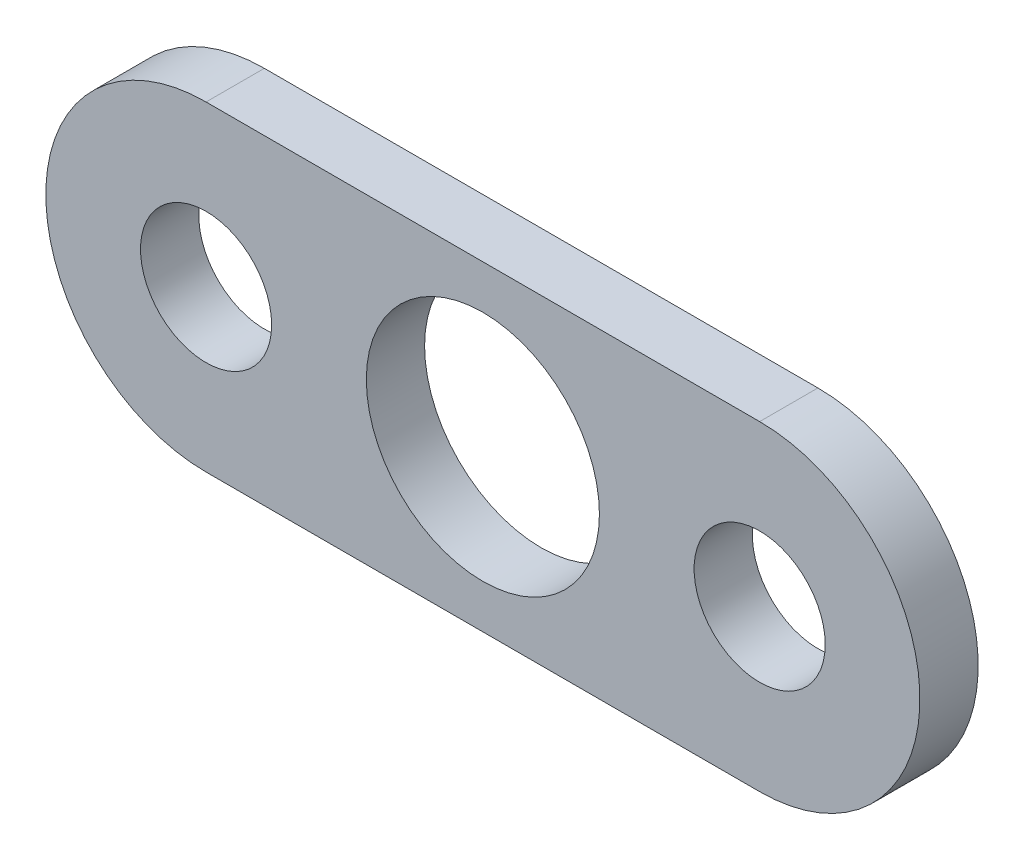
ISO-10303-21;
HEADER;
FILE_DESCRIPTION(('STEP AP214'),'2;1');
FILE_NAME('part.step','',(''),(''),'','','');
FILE_SCHEMA(('AUTOMOTIVE_DESIGN { 1 0 10303 214 1 1 1 1 }'));
ENDSEC;
DATA;
#1=APPLICATION_CONTEXT('core data for automotive mechanical design processes');
#2=APPLICATION_PROTOCOL_DEFINITION('international standard','automotive_design',2000,#1);
#3=PRODUCT_CONTEXT('',#1,'mechanical');
#4=PRODUCT('Part','Part','',(#3));
#5=PRODUCT_RELATED_PRODUCT_CATEGORY('part','',(#4));
#6=PRODUCT_DEFINITION_FORMATION('','',#4);
#7=PRODUCT_DEFINITION_CONTEXT('part definition',#1,'design');
#8=PRODUCT_DEFINITION('design','',#6,#7);
#9=PRODUCT_DEFINITION_SHAPE('','',#8);
#10=(LENGTH_UNIT() NAMED_UNIT(*) SI_UNIT(.MILLI.,.METRE.));
#11=(NAMED_UNIT(*) PLANE_ANGLE_UNIT() SI_UNIT($,.RADIAN.));
#12=(NAMED_UNIT(*) SI_UNIT($,.STERADIAN.) SOLID_ANGLE_UNIT());
#13=UNCERTAINTY_MEASURE_WITH_UNIT(LENGTH_MEASURE(1.E-05),#10,'distance_accuracy_value','');
#14=(GEOMETRIC_REPRESENTATION_CONTEXT(3) GLOBAL_UNCERTAINTY_ASSIGNED_CONTEXT((#13)) GLOBAL_UNIT_ASSIGNED_CONTEXT((#10,
#11,#12)) REPRESENTATION_CONTEXT('',''));
#15=CARTESIAN_POINT('',(0.,0.,0.));
#16=DIRECTION('',(0.,0.,1.));
#17=DIRECTION('',(1.,0.,0.));
#18=AXIS2_PLACEMENT_3D('',#15,#16,#17);
#19=CARTESIAN_POINT('',(-9.5,0.,2.));
#20=DIRECTION('',(0.,0.,1.));
#21=DIRECTION('',(1.,0.,0.));
#22=AXIS2_PLACEMENT_3D('',#19,#20,#21);
#23=PLANE('',#22);
#24=CARTESIAN_POINT('',(-9.5,0.,2.));
#25=DIRECTION('',(0.,0.,1.));
#26=DIRECTION('',(1.,0.,0.));
#27=AXIS2_PLACEMENT_3D('',#24,#25,#26);
#28=CIRCLE('',#27,2.24999999999999);
#29=CARTESIAN_POINT('',(-7.25000000000001,0.,2.));
#30=VERTEX_POINT('',#29);
#31=EDGE_CURVE('E128',#30,#30,#28,.T.);
#32=ORIENTED_EDGE('',*,*,#31,.F.);
#33=EDGE_LOOP('',(#32));
#34=FACE_BOUND('',#33,.T.);
#35=CARTESIAN_POINT('',(9.5,0.,2.));
#36=DIRECTION('',(0.,0.,1.));
#37=DIRECTION('',(1.,0.,0.));
#38=AXIS2_PLACEMENT_3D('',#35,#36,#37);
#39=CIRCLE('',#38,2.24999999999999);
#40=CARTESIAN_POINT('',(11.75,0.,2.));
#41=VERTEX_POINT('',#40);
#42=EDGE_CURVE('E122',#41,#41,#39,.T.);
#43=ORIENTED_EDGE('',*,*,#42,.F.);
#44=EDGE_LOOP('',(#43));
#45=FACE_BOUND('',#44,.T.);
#46=CARTESIAN_POINT('',(-9.5,0.,2.));
#47=DIRECTION('',(0.,0.,1.));
#48=DIRECTION('',(1.,0.,0.));
#49=AXIS2_PLACEMENT_3D('',#46,#47,#48);
#50=CIRCLE('',#49,5.5);
#51=CARTESIAN_POINT('',(-9.5,5.5,2.));
#52=VERTEX_POINT('',#51);
#53=CARTESIAN_POINT('',(-9.5,-5.5,2.));
#54=VERTEX_POINT('',#53);
#55=EDGE_CURVE('E87',#52,#54,#50,.T.);
#56=ORIENTED_EDGE('',*,*,#55,.T.);
#57=DIRECTION('',(1.,0.,0.));
#58=VECTOR('',#57,1.);
#59=CARTESIAN_POINT('',(-9.5,-5.5,2.));
#60=LINE('',#59,#58);
#61=CARTESIAN_POINT('',(9.5,-5.5,2.));
#62=VERTEX_POINT('',#61);
#63=EDGE_CURVE('E82',#54,#62,#60,.T.);
#64=ORIENTED_EDGE('',*,*,#63,.T.);
#65=CARTESIAN_POINT('',(9.5,0.,2.));
#66=DIRECTION('',(0.,0.,1.));
#67=DIRECTION('',(1.,0.,0.));
#68=AXIS2_PLACEMENT_3D('',#65,#66,#67);
#69=CIRCLE('',#68,5.5);
#70=CARTESIAN_POINT('',(9.5,5.5,2.));
#71=VERTEX_POINT('',#70);
#72=EDGE_CURVE('E85',#62,#71,#69,.T.);
#73=ORIENTED_EDGE('',*,*,#72,.T.);
#74=DIRECTION('',(-1.,0.,0.));
#75=VECTOR('',#74,1.);
#76=CARTESIAN_POINT('',(-9.5,5.5,2.));
#77=LINE('',#76,#75);
#78=EDGE_CURVE('E52',#71,#52,#77,.T.);
#79=ORIENTED_EDGE('',*,*,#78,.T.);
#80=EDGE_LOOP('',(#56,#64,#73,#79));
#81=FACE_BOUND('',#80,.T.);
#82=CARTESIAN_POINT('',(0.,0.,2.));
#83=DIRECTION('',(0.,0.,1.));
#84=DIRECTION('',(1.,0.,0.));
#85=AXIS2_PLACEMENT_3D('',#82,#83,#84);
#86=CIRCLE('',#85,4.);
#87=CARTESIAN_POINT('',(4.,0.,2.));
#88=VERTEX_POINT('',#87);
#89=EDGE_CURVE('E102',#88,#88,#86,.T.);
#90=ORIENTED_EDGE('',*,*,#89,.F.);
#91=EDGE_LOOP('',(#90));
#92=FACE_BOUND('',#91,.T.);
#93=ADVANCED_FACE('F35',(#34,#45,#81,#92),#23,.T.);
#94=CARTESIAN_POINT('',(-9.5,0.,0.));
#95=DIRECTION('',(0.,0.,1.));
#96=DIRECTION('',(1.,0.,0.));
#97=AXIS2_PLACEMENT_3D('',#94,#95,#96);
#98=PLANE('',#97);
#99=CARTESIAN_POINT('',(-9.5,0.,0.));
#100=DIRECTION('',(0.,0.,1.));
#101=DIRECTION('',(1.,0.,0.));
#102=AXIS2_PLACEMENT_3D('',#99,#100,#101);
#103=CIRCLE('',#102,2.25);
#104=CARTESIAN_POINT('',(-7.25,0.,0.));
#105=VERTEX_POINT('',#104);
#106=EDGE_CURVE('E125',#105,#105,#103,.T.);
#107=ORIENTED_EDGE('',*,*,#106,.T.);
#108=EDGE_LOOP('',(#107));
#109=FACE_BOUND('',#108,.T.);
#110=CARTESIAN_POINT('',(9.5,0.,0.));
#111=DIRECTION('',(0.,0.,1.));
#112=DIRECTION('',(1.,0.,0.));
#113=AXIS2_PLACEMENT_3D('',#110,#111,#112);
#114=CIRCLE('',#113,2.25);
#115=CARTESIAN_POINT('',(11.75,0.,0.));
#116=VERTEX_POINT('',#115);
#117=EDGE_CURVE('E117',#116,#116,#114,.T.);
#118=ORIENTED_EDGE('',*,*,#117,.T.);
#119=EDGE_LOOP('',(#118));
#120=FACE_BOUND('',#119,.T.);
#121=CARTESIAN_POINT('',(-9.5,0.,0.));
#122=DIRECTION('',(0.,0.,1.));
#123=DIRECTION('',(1.,0.,0.));
#124=AXIS2_PLACEMENT_3D('',#121,#122,#123);
#125=CIRCLE('',#124,5.5);
#126=CARTESIAN_POINT('',(-9.5,5.5,0.));
#127=VERTEX_POINT('',#126);
#128=CARTESIAN_POINT('',(-9.5,-5.5,0.));
#129=VERTEX_POINT('',#128);
#130=EDGE_CURVE('E99',#127,#129,#125,.T.);
#131=ORIENTED_EDGE('',*,*,#130,.F.);
#132=DIRECTION('',(-1.,0.,0.));
#133=VECTOR('',#132,1.);
#134=CARTESIAN_POINT('',(-9.5,5.5,0.));
#135=LINE('',#134,#133);
#136=CARTESIAN_POINT('',(9.5,5.5,0.));
#137=VERTEX_POINT('',#136);
#138=EDGE_CURVE('E75',#137,#127,#135,.T.);
#139=ORIENTED_EDGE('',*,*,#138,.F.);
#140=CARTESIAN_POINT('',(9.5,0.,0.));
#141=DIRECTION('',(0.,0.,1.));
#142=DIRECTION('',(1.,0.,0.));
#143=AXIS2_PLACEMENT_3D('',#140,#141,#142);
#144=CIRCLE('',#143,5.5);
#145=CARTESIAN_POINT('',(9.5,-5.5,0.));
#146=VERTEX_POINT('',#145);
#147=EDGE_CURVE('E69',#146,#137,#144,.T.);
#148=ORIENTED_EDGE('',*,*,#147,.F.);
#149=DIRECTION('',(1.,0.,0.));
#150=VECTOR('',#149,1.);
#151=CARTESIAN_POINT('',(-9.5,-5.5,0.));
#152=LINE('',#151,#150);
#153=EDGE_CURVE('E91',#129,#146,#152,.T.);
#154=ORIENTED_EDGE('',*,*,#153,.F.);
#155=EDGE_LOOP('',(#131,#139,#148,#154));
#156=FACE_BOUND('',#155,.T.);
#157=CARTESIAN_POINT('',(0.,0.,0.));
#158=DIRECTION('',(0.,0.,1.));
#159=DIRECTION('',(1.,0.,0.));
#160=AXIS2_PLACEMENT_3D('',#157,#158,#159);
#161=CIRCLE('',#160,4.);
#162=CARTESIAN_POINT('',(4.,0.,0.));
#163=VERTEX_POINT('',#162);
#164=EDGE_CURVE('E114',#163,#163,#161,.T.);
#165=ORIENTED_EDGE('',*,*,#164,.T.);
#166=EDGE_LOOP('',(#165));
#167=FACE_BOUND('',#166,.T.);
#168=ADVANCED_FACE('F110',(#109,#120,#156,#167),#98,.F.);
#169=CARTESIAN_POINT('',(-9.5,0.,2.));
#170=DIRECTION('',(0.,0.,-1.));
#171=DIRECTION('',(-1.,0.,0.));
#172=AXIS2_PLACEMENT_3D('',#169,#170,#171);
#173=CYLINDRICAL_SURFACE('',#172,5.5);
#174=ORIENTED_EDGE('',*,*,#130,.T.);
#175=DIRECTION('',(0.,0.,-1.));
#176=VECTOR('',#175,1.);
#177=CARTESIAN_POINT('',(-9.5,-5.5,2.));
#178=LINE('',#177,#176);
#179=EDGE_CURVE('E11',#54,#129,#178,.T.);
#180=ORIENTED_EDGE('',*,*,#179,.F.);
#181=ORIENTED_EDGE('',*,*,#55,.F.);
#182=DIRECTION('',(0.,0.,-1.));
#183=VECTOR('',#182,1.);
#184=CARTESIAN_POINT('',(-9.5,5.5,2.));
#185=LINE('',#184,#183);
#186=EDGE_CURVE('E95',#52,#127,#185,.T.);
#187=ORIENTED_EDGE('',*,*,#186,.T.);
#188=EDGE_LOOP('',(#174,#180,#181,#187));
#189=FACE_BOUND('',#188,.T.);
#190=ADVANCED_FACE('F37',(#189),#173,.T.);
#191=CARTESIAN_POINT('',(-9.5,-5.5,2.));
#192=DIRECTION('',(0.,1.,0.));
#193=DIRECTION('',(-1.,0.,0.));
#194=AXIS2_PLACEMENT_3D('',#191,#192,#193);
#195=PLANE('',#194);
#196=ORIENTED_EDGE('',*,*,#153,.T.);
#197=DIRECTION('',(0.,0.,-1.));
#198=VECTOR('',#197,1.);
#199=CARTESIAN_POINT('',(9.5,-5.5,2.));
#200=LINE('',#199,#198);
#201=EDGE_CURVE('E44',#62,#146,#200,.T.);
#202=ORIENTED_EDGE('',*,*,#201,.F.);
#203=ORIENTED_EDGE('',*,*,#63,.F.);
#204=ORIENTED_EDGE('',*,*,#179,.T.);
#205=EDGE_LOOP('',(#196,#202,#203,#204));
#206=FACE_BOUND('',#205,.T.);
#207=ADVANCED_FACE('F90',(#206),#195,.F.);
#208=CARTESIAN_POINT('',(9.5,0.,2.));
#209=DIRECTION('',(0.,0.,-1.));
#210=DIRECTION('',(-1.,0.,0.));
#211=AXIS2_PLACEMENT_3D('',#208,#209,#210);
#212=CYLINDRICAL_SURFACE('',#211,5.5);
#213=ORIENTED_EDGE('',*,*,#147,.T.);
#214=DIRECTION('',(0.,0.,-1.));
#215=VECTOR('',#214,1.);
#216=CARTESIAN_POINT('',(9.5,5.5,2.));
#217=LINE('',#216,#215);
#218=EDGE_CURVE('E92',#71,#137,#217,.T.);
#219=ORIENTED_EDGE('',*,*,#218,.F.);
#220=ORIENTED_EDGE('',*,*,#72,.F.);
#221=ORIENTED_EDGE('',*,*,#201,.T.);
#222=EDGE_LOOP('',(#213,#219,#220,#221));
#223=FACE_BOUND('',#222,.T.);
#224=ADVANCED_FACE('F93',(#223),#212,.T.);
#225=CARTESIAN_POINT('',(-9.5,5.5,2.));
#226=DIRECTION('',(0.,-1.,0.));
#227=DIRECTION('',(1.,0.,0.));
#228=AXIS2_PLACEMENT_3D('',#225,#226,#227);
#229=PLANE('',#228);
#230=ORIENTED_EDGE('',*,*,#138,.T.);
#231=ORIENTED_EDGE('',*,*,#186,.F.);
#232=ORIENTED_EDGE('',*,*,#78,.F.);
#233=ORIENTED_EDGE('',*,*,#218,.T.);
#234=EDGE_LOOP('',(#230,#231,#232,#233));
#235=FACE_BOUND('',#234,.T.);
#236=ADVANCED_FACE('F107',(#235),#229,.F.);
#237=CARTESIAN_POINT('',(0.,0.,2.));
#238=DIRECTION('',(0.,0.,-1.));
#239=DIRECTION('',(-1.,0.,0.));
#240=AXIS2_PLACEMENT_3D('',#237,#238,#239);
#241=CYLINDRICAL_SURFACE('',#240,4.);
#242=ORIENTED_EDGE('',*,*,#89,.T.);
#243=EDGE_LOOP('',(#242));
#244=FACE_BOUND('',#243,.T.);
#245=ORIENTED_EDGE('',*,*,#164,.F.);
#246=EDGE_LOOP('',(#245));
#247=FACE_BOUND('',#246,.T.);
#248=ADVANCED_FACE('F141',(#244,#247),#241,.F.);
#249=CARTESIAN_POINT('',(9.5,0.,2.));
#250=DIRECTION('',(0.,0.,1.));
#251=DIRECTION('',(1.,0.,0.));
#252=AXIS2_PLACEMENT_3D('',#249,#250,#251);
#253=CYLINDRICAL_SURFACE('',#252,2.24999999999999);
#254=ORIENTED_EDGE('',*,*,#117,.F.);
#255=EDGE_LOOP('',(#254));
#256=FACE_BOUND('',#255,.T.);
#257=ORIENTED_EDGE('',*,*,#42,.T.);
#258=EDGE_LOOP('',(#257));
#259=FACE_BOUND('',#258,.T.);
#260=ADVANCED_FACE('F139',(#256,#259),#253,.F.);
#261=CARTESIAN_POINT('',(-9.5,0.,2.));
#262=DIRECTION('',(0.,0.,1.));
#263=DIRECTION('',(1.,0.,0.));
#264=AXIS2_PLACEMENT_3D('',#261,#262,#263);
#265=CYLINDRICAL_SURFACE('',#264,2.24999999999999);
#266=ORIENTED_EDGE('',*,*,#106,.F.);
#267=EDGE_LOOP('',(#266));
#268=FACE_BOUND('',#267,.T.);
#269=ORIENTED_EDGE('',*,*,#31,.T.);
#270=EDGE_LOOP('',(#269));
#271=FACE_BOUND('',#270,.T.);
#272=ADVANCED_FACE('F132',(#268,#271),#265,.F.);
#273=CLOSED_SHELL('',(#93,#168,#190,#207,#224,#236,#248,#260,#272));
#274=MANIFOLD_SOLID_BREP('B2',#273);
#275=ADVANCED_BREP_SHAPE_REPRESENTATION('',(#18,#274),#14);
#276=SHAPE_DEFINITION_REPRESENTATION(#9,#275);
ENDSEC;
END-ISO-10303-21;
